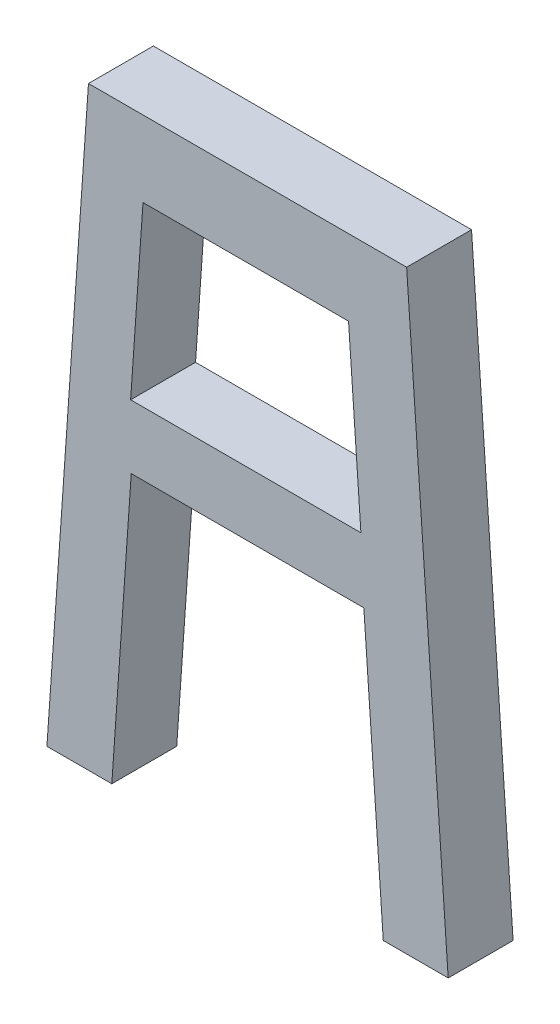
ISO-10303-21;
HEADER;
FILE_DESCRIPTION(('STEP AP214'),'2;1');
FILE_NAME('part.step','',(''),(''),'','','');
FILE_SCHEMA(('AUTOMOTIVE_DESIGN { 1 0 10303 214 1 1 1 1 }'));
ENDSEC;
DATA;
#1=APPLICATION_CONTEXT('core data for automotive mechanical design processes');
#2=APPLICATION_PROTOCOL_DEFINITION('international standard','automotive_design',2000,#1);
#3=PRODUCT_CONTEXT('',#1,'mechanical');
#4=PRODUCT('Part','Part','',(#3));
#5=PRODUCT_RELATED_PRODUCT_CATEGORY('part','',(#4));
#6=PRODUCT_DEFINITION_FORMATION('','',#4);
#7=PRODUCT_DEFINITION_CONTEXT('part definition',#1,'design');
#8=PRODUCT_DEFINITION('design','',#6,#7);
#9=PRODUCT_DEFINITION_SHAPE('','',#8);
#10=(LENGTH_UNIT() NAMED_UNIT(*) SI_UNIT(.MILLI.,.METRE.));
#11=(NAMED_UNIT(*) PLANE_ANGLE_UNIT() SI_UNIT($,.RADIAN.));
#12=(NAMED_UNIT(*) SI_UNIT($,.STERADIAN.) SOLID_ANGLE_UNIT());
#13=UNCERTAINTY_MEASURE_WITH_UNIT(LENGTH_MEASURE(1.E-05),#10,'distance_accuracy_value','');
#14=(GEOMETRIC_REPRESENTATION_CONTEXT(3) GLOBAL_UNCERTAINTY_ASSIGNED_CONTEXT((#13)) GLOBAL_UNIT_ASSIGNED_CONTEXT((#10,
#11,#12)) REPRESENTATION_CONTEXT('',''));
#15=CARTESIAN_POINT('',(0.,0.,0.));
#16=DIRECTION('',(0.,0.,1.));
#17=DIRECTION('',(1.,0.,0.));
#18=AXIS2_PLACEMENT_3D('',#15,#16,#17);
#19=CARTESIAN_POINT('',(-26.5589804005854,44.2966755175553,12.7));
#20=DIRECTION('',(-0.997568655280574,0.0696905876120076,0.));
#21=DIRECTION('',(-0.0696905876120076,-0.997568655280574,0.));
#22=AXIS2_PLACEMENT_3D('',#19,#20,#21);
#23=PLANE('',#22);
#24=DIRECTION('',(0.0696905876120075,0.997568655280574,0.));
#25=VECTOR('',#24,1.);
#26=CARTESIAN_POINT('',(-26.5589804005854,44.2966755175553,0.));
#27=LINE('',#26,#25);
#28=CARTESIAN_POINT('',(-26.5589804005854,44.2966755175553,0.));
#29=VERTEX_POINT('',#28);
#30=CARTESIAN_POINT('',(-22.7539143580636,98.7633509375553,0.));
#31=VERTEX_POINT('',#30);
#32=EDGE_CURVE('E154',#29,#31,#27,.T.);
#33=ORIENTED_EDGE('',*,*,#32,.T.);
#34=DIRECTION('',(0.,0.,-1.));
#35=VECTOR('',#34,1.);
#36=CARTESIAN_POINT('',(-22.7539143580636,98.7633509375553,12.7));
#37=LINE('',#36,#35);
#38=CARTESIAN_POINT('',(-22.7539143580636,98.7633509375553,12.7));
#39=VERTEX_POINT('',#38);
#40=EDGE_CURVE('E11',#39,#31,#37,.T.);
#41=ORIENTED_EDGE('',*,*,#40,.F.);
#42=DIRECTION('',(0.0696905876120075,0.997568655280574,0.));
#43=VECTOR('',#42,1.);
#44=CARTESIAN_POINT('',(-26.5589804005854,44.2966755175553,12.7));
#45=LINE('',#44,#43);
#46=CARTESIAN_POINT('',(-26.5589804005854,44.2966755175553,12.7));
#47=VERTEX_POINT('',#46);
#48=EDGE_CURVE('E158',#47,#39,#45,.T.);
#49=ORIENTED_EDGE('',*,*,#48,.F.);
#50=DIRECTION('',(0.,0.,-1.));
#51=VECTOR('',#50,1.);
#52=CARTESIAN_POINT('',(-26.5589804005854,44.2966755175553,12.7));
#53=LINE('',#52,#51);
#54=EDGE_CURVE('E180',#47,#29,#53,.T.);
#55=ORIENTED_EDGE('',*,*,#54,.T.);
#56=EDGE_LOOP('',(#33,#41,#49,#55));
#57=FACE_BOUND('',#56,.T.);
#58=ADVANCED_FACE('F33',(#57),#23,.F.);
#59=CARTESIAN_POINT('',(-22.7539143580636,98.7633509375553,12.7));
#60=DIRECTION('',(0.,1.,0.));
#61=DIRECTION('',(0.,0.,1.));
#62=AXIS2_PLACEMENT_3D('',#59,#60,#61);
#63=PLANE('',#62);
#64=DIRECTION('',(1.,0.,0.));
#65=VECTOR('',#64,1.);
#66=CARTESIAN_POINT('',(-22.7539143580636,98.7633509375553,0.));
#67=LINE('',#66,#65);
#68=CARTESIAN_POINT('',(22.7539143580636,98.7633509375553,0.));
#69=VERTEX_POINT('',#68);
#70=EDGE_CURVE('E183',#31,#69,#67,.T.);
#71=ORIENTED_EDGE('',*,*,#70,.T.);
#72=DIRECTION('',(0.,0.,-1.));
#73=VECTOR('',#72,1.);
#74=CARTESIAN_POINT('',(22.7539143580636,98.7633509375553,12.7));
#75=LINE('',#74,#73);
#76=CARTESIAN_POINT('',(22.7539143580636,98.7633509375553,12.7));
#77=VERTEX_POINT('',#76);
#78=EDGE_CURVE('E40',#77,#69,#75,.T.);
#79=ORIENTED_EDGE('',*,*,#78,.F.);
#80=DIRECTION('',(1.,0.,0.));
#81=VECTOR('',#80,1.);
#82=CARTESIAN_POINT('',(-22.7539143580636,98.7633509375553,12.7));
#83=LINE('',#82,#81);
#84=EDGE_CURVE('E161',#39,#77,#83,.T.);
#85=ORIENTED_EDGE('',*,*,#84,.F.);
#86=ORIENTED_EDGE('',*,*,#40,.T.);
#87=EDGE_LOOP('',(#71,#79,#85,#86));
#88=FACE_BOUND('',#87,.T.);
#89=ADVANCED_FACE('F247',(#88),#63,.F.);
#90=CARTESIAN_POINT('',(22.7539143580636,98.7633509375553,12.7));
#91=DIRECTION('',(0.997568655280574,0.0696905876120076,0.));
#92=DIRECTION('',(-0.0696905876120076,0.997568655280574,0.));
#93=AXIS2_PLACEMENT_3D('',#90,#91,#92);
#94=PLANE('',#93);
#95=DIRECTION('',(0.0696905876120075,-0.997568655280574,0.));
#96=VECTOR('',#95,1.);
#97=CARTESIAN_POINT('',(22.7539143580636,98.7633509375553,0.));
#98=LINE('',#97,#96);
#99=CARTESIAN_POINT('',(26.5589804005854,44.2966755175553,0.));
#100=VERTEX_POINT('',#99);
#101=EDGE_CURVE('E185',#69,#100,#98,.T.);
#102=ORIENTED_EDGE('',*,*,#101,.T.);
#103=DIRECTION('',(0.,0.,-1.));
#104=VECTOR('',#103,1.);
#105=CARTESIAN_POINT('',(26.5589804005854,44.2966755175553,12.7));
#106=LINE('',#105,#104);
#107=CARTESIAN_POINT('',(26.5589804005854,44.2966755175553,12.7));
#108=VERTEX_POINT('',#107);
#109=EDGE_CURVE('E211',#108,#100,#106,.T.);
#110=ORIENTED_EDGE('',*,*,#109,.F.);
#111=DIRECTION('',(0.0696905876120075,-0.997568655280574,0.));
#112=VECTOR('',#111,1.);
#113=CARTESIAN_POINT('',(22.7539143580636,98.7633509375553,12.7));
#114=LINE('',#113,#112);
#115=EDGE_CURVE('E164',#77,#108,#114,.T.);
#116=ORIENTED_EDGE('',*,*,#115,.F.);
#117=ORIENTED_EDGE('',*,*,#78,.T.);
#118=EDGE_LOOP('',(#102,#110,#116,#117));
#119=FACE_BOUND('',#118,.T.);
#120=ADVANCED_FACE('F217',(#119),#94,.F.);
#121=CARTESIAN_POINT('',(39.2589804005854,44.2966755175553,12.7));
#122=DIRECTION('',(0.,-1.,0.));
#123=DIRECTION('',(1.,0.,0.));
#124=AXIS2_PLACEMENT_3D('',#121,#122,#123);
#125=PLANE('',#124);
#126=DIRECTION('',(-1.,0.,0.));
#127=VECTOR('',#126,1.);
#128=CARTESIAN_POINT('',(39.2589804005854,44.2966755175553,0.));
#129=LINE('',#128,#127);
#130=CARTESIAN_POINT('',(39.2589804005854,44.2966755175553,0.));
#131=VERTEX_POINT('',#130);
#132=EDGE_CURVE('E188',#131,#100,#129,.T.);
#133=ORIENTED_EDGE('',*,*,#132,.F.);
#134=DIRECTION('',(0.,0.,-1.));
#135=VECTOR('',#134,1.);
#136=CARTESIAN_POINT('',(39.2589804005854,44.2966755175553,12.7));
#137=LINE('',#136,#135);
#138=CARTESIAN_POINT('',(39.2589804005854,44.2966755175553,12.7));
#139=VERTEX_POINT('',#138);
#140=EDGE_CURVE('E209',#139,#131,#137,.T.);
#141=ORIENTED_EDGE('',*,*,#140,.F.);
#142=DIRECTION('',(-1.,0.,0.));
#143=VECTOR('',#142,1.);
#144=CARTESIAN_POINT('',(39.2589804005854,44.2966755175553,12.7));
#145=LINE('',#144,#143);
#146=EDGE_CURVE('E166',#139,#108,#145,.T.);
#147=ORIENTED_EDGE('',*,*,#146,.T.);
#148=ORIENTED_EDGE('',*,*,#109,.T.);
#149=EDGE_LOOP('',(#133,#141,#147,#148));
#150=FACE_BOUND('',#149,.T.);
#151=ADVANCED_FACE('F224',(#150),#125,.T.);
#152=CARTESIAN_POINT('',(31.1281102579533,160.684002305555,12.7));
#153=DIRECTION('',(0.997568655280574,0.0696905876120076,0.));
#154=DIRECTION('',(-0.0696905876120076,0.997568655280574,0.));
#155=AXIS2_PLACEMENT_3D('',#152,#153,#154);
#156=PLANE('',#155);
#157=DIRECTION('',(0.0696905876120076,-0.997568655280574,0.));
#158=VECTOR('',#157,1.);
#159=CARTESIAN_POINT('',(31.1281102579533,160.684002305555,0.));
#160=LINE('',#159,#158);
#161=CARTESIAN_POINT('',(31.1281102579533,160.684002305555,0.));
#162=VERTEX_POINT('',#161);
#163=EDGE_CURVE('E191',#162,#131,#160,.T.);
#164=ORIENTED_EDGE('',*,*,#163,.F.);
#165=DIRECTION('',(0.,0.,-1.));
#166=VECTOR('',#165,1.);
#167=CARTESIAN_POINT('',(31.1281102579533,160.684002305555,12.7));
#168=LINE('',#167,#166);
#169=CARTESIAN_POINT('',(31.1281102579533,160.684002305555,12.7));
#170=VERTEX_POINT('',#169);
#171=EDGE_CURVE('E207',#170,#162,#168,.T.);
#172=ORIENTED_EDGE('',*,*,#171,.F.);
#173=DIRECTION('',(0.0696905876120076,-0.997568655280574,0.));
#174=VECTOR('',#173,1.);
#175=CARTESIAN_POINT('',(31.1281102579533,160.684002305555,12.7));
#176=LINE('',#175,#174);
#177=EDGE_CURVE('E169',#170,#139,#176,.T.);
#178=ORIENTED_EDGE('',*,*,#177,.T.);
#179=ORIENTED_EDGE('',*,*,#140,.T.);
#180=EDGE_LOOP('',(#164,#172,#178,#179));
#181=FACE_BOUND('',#180,.T.);
#182=ADVANCED_FACE('F231',(#181),#156,.T.);
#183=CARTESIAN_POINT('',(-31.1281102579533,160.684002305555,12.7));
#184=DIRECTION('',(0.,1.,0.));
#185=DIRECTION('',(0.,0.,1.));
#186=AXIS2_PLACEMENT_3D('',#183,#184,#185);
#187=PLANE('',#186);
#188=DIRECTION('',(1.,0.,0.));
#189=VECTOR('',#188,1.);
#190=CARTESIAN_POINT('',(-31.1281102579533,160.684002305555,0.));
#191=LINE('',#190,#189);
#192=CARTESIAN_POINT('',(-31.1281102579533,160.684002305555,0.));
#193=VERTEX_POINT('',#192);
#194=EDGE_CURVE('E194',#193,#162,#191,.T.);
#195=ORIENTED_EDGE('',*,*,#194,.F.);
#196=DIRECTION('',(0.,0.,-1.));
#197=VECTOR('',#196,1.);
#198=CARTESIAN_POINT('',(-31.1281102579533,160.684002305555,12.7));
#199=LINE('',#198,#197);
#200=CARTESIAN_POINT('',(-31.1281102579533,160.684002305555,12.7));
#201=VERTEX_POINT('',#200);
#202=EDGE_CURVE('E205',#201,#193,#199,.T.);
#203=ORIENTED_EDGE('',*,*,#202,.F.);
#204=DIRECTION('',(1.,0.,0.));
#205=VECTOR('',#204,1.);
#206=CARTESIAN_POINT('',(-31.1281102579533,160.684002305555,12.7));
#207=LINE('',#206,#205);
#208=EDGE_CURVE('E172',#201,#170,#207,.T.);
#209=ORIENTED_EDGE('',*,*,#208,.T.);
#210=ORIENTED_EDGE('',*,*,#171,.T.);
#211=EDGE_LOOP('',(#195,#203,#209,#210));
#212=FACE_BOUND('',#211,.T.);
#213=ADVANCED_FACE('F234',(#212),#187,.T.);
#214=CARTESIAN_POINT('',(-39.2589804005854,44.2966755175553,12.7));
#215=DIRECTION('',(-0.997568655280574,0.0696905876120076,0.));
#216=DIRECTION('',(-0.0696905876120076,-0.997568655280574,0.));
#217=AXIS2_PLACEMENT_3D('',#214,#215,#216);
#218=PLANE('',#217);
#219=DIRECTION('',(0.0696905876120076,0.997568655280574,0.));
#220=VECTOR('',#219,1.);
#221=CARTESIAN_POINT('',(-39.2589804005854,44.2966755175553,0.));
#222=LINE('',#221,#220);
#223=CARTESIAN_POINT('',(-39.2589804005854,44.2966755175553,0.));
#224=VERTEX_POINT('',#223);
#225=EDGE_CURVE('E197',#224,#193,#222,.T.);
#226=ORIENTED_EDGE('',*,*,#225,.F.);
#227=DIRECTION('',(0.,0.,-1.));
#228=VECTOR('',#227,1.);
#229=CARTESIAN_POINT('',(-39.2589804005854,44.2966755175553,12.7));
#230=LINE('',#229,#228);
#231=CARTESIAN_POINT('',(-39.2589804005854,44.2966755175553,12.7));
#232=VERTEX_POINT('',#231);
#233=EDGE_CURVE('E203',#232,#224,#230,.T.);
#234=ORIENTED_EDGE('',*,*,#233,.F.);
#235=DIRECTION('',(0.0696905876120076,0.997568655280574,0.));
#236=VECTOR('',#235,1.);
#237=CARTESIAN_POINT('',(-39.2589804005854,44.2966755175553,12.7));
#238=LINE('',#237,#236);
#239=EDGE_CURVE('E175',#232,#201,#238,.T.);
#240=ORIENTED_EDGE('',*,*,#239,.T.);
#241=ORIENTED_EDGE('',*,*,#202,.T.);
#242=EDGE_LOOP('',(#226,#234,#240,#241));
#243=FACE_BOUND('',#242,.T.);
#244=ADVANCED_FACE('F238',(#243),#218,.T.);
#245=CARTESIAN_POINT('',(-39.2589804005854,44.2966755175553,12.7));
#246=DIRECTION('',(0.,1.,0.));
#247=DIRECTION('',(0.,0.,1.));
#248=AXIS2_PLACEMENT_3D('',#245,#246,#247);
#249=PLANE('',#248);
#250=DIRECTION('',(1.,0.,0.));
#251=VECTOR('',#250,1.);
#252=CARTESIAN_POINT('',(-39.2589804005854,44.2966755175553,0.));
#253=LINE('',#252,#251);
#254=EDGE_CURVE('E162',#224,#29,#253,.T.);
#255=ORIENTED_EDGE('',*,*,#254,.T.);
#256=ORIENTED_EDGE('',*,*,#54,.F.);
#257=DIRECTION('',(1.,0.,0.));
#258=VECTOR('',#257,1.);
#259=CARTESIAN_POINT('',(-39.2589804005854,44.2966755175553,12.7));
#260=LINE('',#259,#258);
#261=EDGE_CURVE('E178',#232,#47,#260,.T.);
#262=ORIENTED_EDGE('',*,*,#261,.F.);
#263=ORIENTED_EDGE('',*,*,#233,.T.);
#264=EDGE_LOOP('',(#255,#256,#262,#263));
#265=FACE_BOUND('',#264,.T.);
#266=ADVANCED_FACE('F243',(#265),#249,.F.);
#267=CARTESIAN_POINT('',(0.,0.,12.7));
#268=DIRECTION('',(0.,0.,-1.));
#269=DIRECTION('',(-1.,0.,0.));
#270=AXIS2_PLACEMENT_3D('',#267,#268,#269);
#271=PLANE('',#270);
#272=DIRECTION('',(-0.0696905876120073,-0.997568655280574,0.));
#273=VECTOR('',#272,1.);
#274=CARTESIAN_POINT('',(-20.4586860108829,145.848553896899,12.7));
#275=LINE('',#274,#273);
#276=CARTESIAN_POINT('',(-20.4586860108829,145.848553896899,12.7));
#277=VERTEX_POINT('',#276);
#278=CARTESIAN_POINT('',(-22.8789322113775,111.204539110899,12.7));
#279=VERTEX_POINT('',#278);
#280=EDGE_CURVE('E148',#277,#279,#275,.T.);
#281=ORIENTED_EDGE('',*,*,#280,.F.);
#282=DIRECTION('',(-1.,0.,0.));
#283=VECTOR('',#282,1.);
#284=CARTESIAN_POINT('',(19.7621292213551,145.848553896899,12.7));
#285=LINE('',#284,#283);
#286=CARTESIAN_POINT('',(19.7621292213551,145.848553896899,12.7));
#287=VERTEX_POINT('',#286);
#288=EDGE_CURVE('E47',#287,#277,#285,.T.);
#289=ORIENTED_EDGE('',*,*,#288,.F.);
#290=DIRECTION('',(-0.0696905876120076,0.997568655280574,0.));
#291=VECTOR('',#290,1.);
#292=CARTESIAN_POINT('',(22.1823754218498,111.204539110899,12.7));
#293=LINE('',#292,#291);
#294=CARTESIAN_POINT('',(22.1823754218498,111.204539110899,12.7));
#295=VERTEX_POINT('',#294);
#296=EDGE_CURVE('E139',#295,#287,#293,.T.);
#297=ORIENTED_EDGE('',*,*,#296,.F.);
#298=DIRECTION('',(1.,0.,0.));
#299=VECTOR('',#298,1.);
#300=CARTESIAN_POINT('',(-22.8789322113775,111.204539110899,12.7));
#301=LINE('',#300,#299);
#302=EDGE_CURVE('E142',#279,#295,#301,.T.);
#303=ORIENTED_EDGE('',*,*,#302,.F.);
#304=EDGE_LOOP('',(#281,#289,#297,#303));
#305=FACE_BOUND('',#304,.T.);
#306=ORIENTED_EDGE('',*,*,#48,.T.);
#307=ORIENTED_EDGE('',*,*,#84,.T.);
#308=ORIENTED_EDGE('',*,*,#115,.T.);
#309=ORIENTED_EDGE('',*,*,#146,.F.);
#310=ORIENTED_EDGE('',*,*,#177,.F.);
#311=ORIENTED_EDGE('',*,*,#208,.F.);
#312=ORIENTED_EDGE('',*,*,#239,.F.);
#313=ORIENTED_EDGE('',*,*,#261,.T.);
#314=EDGE_LOOP('',(#306,#307,#308,#309,#310,#311,#312,#313));
#315=FACE_BOUND('',#314,.T.);
#316=ADVANCED_FACE('F228',(#305,#315),#271,.F.);
#317=CARTESIAN_POINT('',(0.,0.,0.));
#318=DIRECTION('',(0.,0.,-1.));
#319=DIRECTION('',(-1.,0.,0.));
#320=AXIS2_PLACEMENT_3D('',#317,#318,#319);
#321=PLANE('',#320);
#322=DIRECTION('',(-1.,0.,0.));
#323=VECTOR('',#322,1.);
#324=CARTESIAN_POINT('',(19.7621292213551,145.848553896899,0.));
#325=LINE('',#324,#323);
#326=CARTESIAN_POINT('',(19.7621292213551,145.848553896899,0.));
#327=VERTEX_POINT('',#326);
#328=CARTESIAN_POINT('',(-20.4586860108829,145.848553896899,0.));
#329=VERTEX_POINT('',#328);
#330=EDGE_CURVE('E123',#327,#329,#325,.T.);
#331=ORIENTED_EDGE('',*,*,#330,.T.);
#332=DIRECTION('',(-0.0696905876120073,-0.997568655280574,0.));
#333=VECTOR('',#332,1.);
#334=CARTESIAN_POINT('',(-20.4586860108829,145.848553896899,0.));
#335=LINE('',#334,#333);
#336=CARTESIAN_POINT('',(-22.8789322113775,111.204539110899,0.));
#337=VERTEX_POINT('',#336);
#338=EDGE_CURVE('E132',#329,#337,#335,.T.);
#339=ORIENTED_EDGE('',*,*,#338,.T.);
#340=DIRECTION('',(1.,0.,0.));
#341=VECTOR('',#340,1.);
#342=CARTESIAN_POINT('',(-22.8789322113775,111.204539110899,0.));
#343=LINE('',#342,#341);
#344=CARTESIAN_POINT('',(22.1823754218498,111.204539110899,0.));
#345=VERTEX_POINT('',#344);
#346=EDGE_CURVE('E55',#337,#345,#343,.T.);
#347=ORIENTED_EDGE('',*,*,#346,.T.);
#348=DIRECTION('',(-0.0696905876120076,0.997568655280574,0.));
#349=VECTOR('',#348,1.);
#350=CARTESIAN_POINT('',(22.1823754218498,111.204539110899,0.));
#351=LINE('',#350,#349);
#352=EDGE_CURVE('E129',#345,#327,#351,.T.);
#353=ORIENTED_EDGE('',*,*,#352,.T.);
#354=EDGE_LOOP('',(#331,#339,#347,#353));
#355=FACE_BOUND('',#354,.T.);
#356=ORIENTED_EDGE('',*,*,#32,.F.);
#357=ORIENTED_EDGE('',*,*,#254,.F.);
#358=ORIENTED_EDGE('',*,*,#225,.T.);
#359=ORIENTED_EDGE('',*,*,#194,.T.);
#360=ORIENTED_EDGE('',*,*,#163,.T.);
#361=ORIENTED_EDGE('',*,*,#132,.T.);
#362=ORIENTED_EDGE('',*,*,#101,.F.);
#363=ORIENTED_EDGE('',*,*,#70,.F.);
#364=EDGE_LOOP('',(#356,#357,#358,#359,#360,#361,#362,#363));
#365=FACE_BOUND('',#364,.T.);
#366=ADVANCED_FACE('F136',(#355,#365),#321,.T.);
#367=CARTESIAN_POINT('',(19.7621292213551,145.848553896899,0.));
#368=DIRECTION('',(0.,1.,0.));
#369=DIRECTION('',(0.,0.,1.));
#370=AXIS2_PLACEMENT_3D('',#367,#368,#369);
#371=PLANE('',#370);
#372=ORIENTED_EDGE('',*,*,#288,.T.);
#373=DIRECTION('',(0.,0.,1.));
#374=VECTOR('',#373,1.);
#375=CARTESIAN_POINT('',(-20.4586860108829,145.848553896899,0.));
#376=LINE('',#375,#374);
#377=EDGE_CURVE('E119',#329,#277,#376,.T.);
#378=ORIENTED_EDGE('',*,*,#377,.F.);
#379=ORIENTED_EDGE('',*,*,#330,.F.);
#380=DIRECTION('',(0.,0.,1.));
#381=VECTOR('',#380,1.);
#382=CARTESIAN_POINT('',(19.7621292213551,145.848553896899,0.));
#383=LINE('',#382,#381);
#384=EDGE_CURVE('E152',#327,#287,#383,.T.);
#385=ORIENTED_EDGE('',*,*,#384,.T.);
#386=EDGE_LOOP('',(#372,#378,#379,#385));
#387=FACE_BOUND('',#386,.T.);
#388=ADVANCED_FACE('F121',(#387),#371,.F.);
#389=CARTESIAN_POINT('',(22.1823754218498,111.204539110899,0.));
#390=DIRECTION('',(0.997568655280574,0.0696905876120076,0.));
#391=DIRECTION('',(-0.0696905876120076,0.997568655280574,0.));
#392=AXIS2_PLACEMENT_3D('',#389,#390,#391);
#393=PLANE('',#392);
#394=ORIENTED_EDGE('',*,*,#296,.T.);
#395=ORIENTED_EDGE('',*,*,#384,.F.);
#396=ORIENTED_EDGE('',*,*,#352,.F.);
#397=DIRECTION('',(0.,0.,1.));
#398=VECTOR('',#397,1.);
#399=CARTESIAN_POINT('',(22.1823754218498,111.204539110899,0.));
#400=LINE('',#399,#398);
#401=EDGE_CURVE('E155',#345,#295,#400,.T.);
#402=ORIENTED_EDGE('',*,*,#401,.T.);
#403=EDGE_LOOP('',(#394,#395,#396,#402));
#404=FACE_BOUND('',#403,.T.);
#405=ADVANCED_FACE('F272',(#404),#393,.F.);
#406=CARTESIAN_POINT('',(-22.8789322113775,111.204539110899,0.));
#407=DIRECTION('',(0.,-1.,0.));
#408=DIRECTION('',(0.,0.,-1.));
#409=AXIS2_PLACEMENT_3D('',#406,#407,#408);
#410=PLANE('',#409);
#411=ORIENTED_EDGE('',*,*,#302,.T.);
#412=ORIENTED_EDGE('',*,*,#401,.F.);
#413=ORIENTED_EDGE('',*,*,#346,.F.);
#414=DIRECTION('',(0.,0.,1.));
#415=VECTOR('',#414,1.);
#416=CARTESIAN_POINT('',(-22.8789322113775,111.204539110899,0.));
#417=LINE('',#416,#415);
#418=EDGE_CURVE('E128',#337,#279,#417,.T.);
#419=ORIENTED_EDGE('',*,*,#418,.T.);
#420=EDGE_LOOP('',(#411,#412,#413,#419));
#421=FACE_BOUND('',#420,.T.);
#422=ADVANCED_FACE('F275',(#421),#410,.F.);
#423=CARTESIAN_POINT('',(-20.4586860108829,145.848553896899,0.));
#424=DIRECTION('',(-0.997568655280574,0.0696905876120073,0.));
#425=DIRECTION('',(-0.0696905876120073,-0.997568655280574,0.));
#426=AXIS2_PLACEMENT_3D('',#423,#424,#425);
#427=PLANE('',#426);
#428=ORIENTED_EDGE('',*,*,#280,.T.);
#429=ORIENTED_EDGE('',*,*,#418,.F.);
#430=ORIENTED_EDGE('',*,*,#338,.F.);
#431=ORIENTED_EDGE('',*,*,#377,.T.);
#432=EDGE_LOOP('',(#428,#429,#430,#431));
#433=FACE_BOUND('',#432,.T.);
#434=ADVANCED_FACE('F133',(#433),#427,.F.);
#435=CLOSED_SHELL('',(#58,#89,#120,#151,#182,#213,#244,#266,#316,#366,#388,#405,#422,#434));
#436=MANIFOLD_SOLID_BREP('B2',#435);
#437=ADVANCED_BREP_SHAPE_REPRESENTATION('',(#18,#436),#14);
#438=SHAPE_DEFINITION_REPRESENTATION(#9,#437);
ENDSEC;
END-ISO-10303-21;
